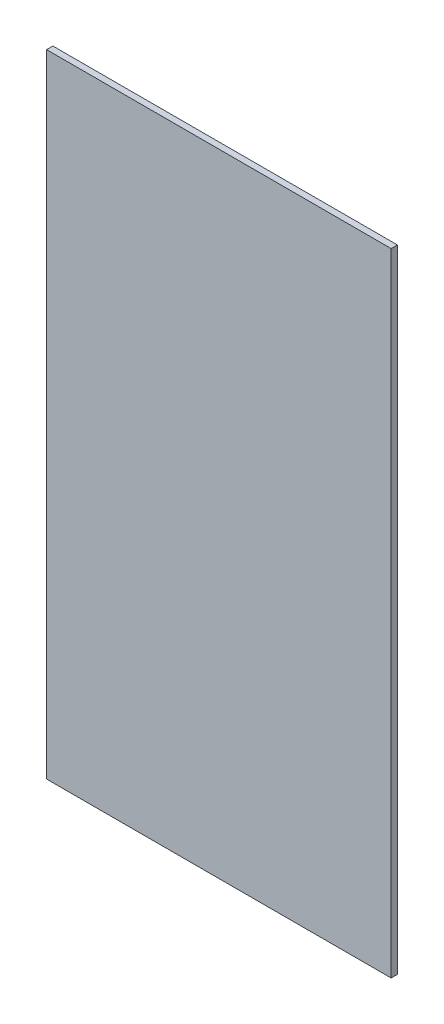
ISO-10303-21;
HEADER;
FILE_DESCRIPTION(('STEP AP214'),'2;1');
FILE_NAME('part.step','',(''),(''),'','','');
FILE_SCHEMA(('AUTOMOTIVE_DESIGN { 1 0 10303 214 1 1 1 1 }'));
ENDSEC;
DATA;
#1=APPLICATION_CONTEXT('core data for automotive mechanical design processes');
#2=APPLICATION_PROTOCOL_DEFINITION('international standard','automotive_design',2000,#1);
#3=PRODUCT_CONTEXT('',#1,'mechanical');
#4=PRODUCT('Part','Part','',(#3));
#5=PRODUCT_RELATED_PRODUCT_CATEGORY('part','',(#4));
#6=PRODUCT_DEFINITION_FORMATION('','',#4);
#7=PRODUCT_DEFINITION_CONTEXT('part definition',#1,'design');
#8=PRODUCT_DEFINITION('design','',#6,#7);
#9=PRODUCT_DEFINITION_SHAPE('','',#8);
#10=(LENGTH_UNIT() NAMED_UNIT(*) SI_UNIT(.MILLI.,.METRE.));
#11=(NAMED_UNIT(*) PLANE_ANGLE_UNIT() SI_UNIT($,.RADIAN.));
#12=(NAMED_UNIT(*) SI_UNIT($,.STERADIAN.) SOLID_ANGLE_UNIT());
#13=UNCERTAINTY_MEASURE_WITH_UNIT(LENGTH_MEASURE(1.E-05),#10,'distance_accuracy_value','');
#14=(GEOMETRIC_REPRESENTATION_CONTEXT(3) GLOBAL_UNCERTAINTY_ASSIGNED_CONTEXT((#13)) GLOBAL_UNIT_ASSIGNED_CONTEXT((#10,
#11,#12)) REPRESENTATION_CONTEXT('',''));
#15=CARTESIAN_POINT('',(0.,0.,0.));
#16=DIRECTION('',(0.,0.,1.));
#17=DIRECTION('',(1.,0.,0.));
#18=AXIS2_PLACEMENT_3D('',#15,#16,#17);
#19=CARTESIAN_POINT('',(0.,0.,11.1125));
#20=DIRECTION('',(1.,0.,0.));
#21=DIRECTION('',(0.,0.,-1.));
#22=AXIS2_PLACEMENT_3D('',#19,#20,#21);
#23=PLANE('',#22);
#24=DIRECTION('',(0.,-1.,0.));
#25=VECTOR('',#24,1.);
#26=CARTESIAN_POINT('',(0.,0.,0.));
#27=LINE('',#26,#25);
#28=CARTESIAN_POINT('',(0.,1117.6,0.));
#29=VERTEX_POINT('',#28);
#30=CARTESIAN_POINT('',(0.,0.,0.));
#31=VERTEX_POINT('',#30);
#32=EDGE_CURVE('E98',#29,#31,#27,.T.);
#33=ORIENTED_EDGE('',*,*,#32,.T.);
#34=DIRECTION('',(0.,0.,-1.));
#35=VECTOR('',#34,1.);
#36=CARTESIAN_POINT('',(0.,0.,11.1125));
#37=LINE('',#36,#35);
#38=CARTESIAN_POINT('',(0.,0.,11.1125));
#39=VERTEX_POINT('',#38);
#40=EDGE_CURVE('E11',#39,#31,#37,.T.);
#41=ORIENTED_EDGE('',*,*,#40,.F.);
#42=DIRECTION('',(0.,-1.,0.));
#43=VECTOR('',#42,1.);
#44=CARTESIAN_POINT('',(0.,0.,11.1125));
#45=LINE('',#44,#43);
#46=CARTESIAN_POINT('',(0.,1117.6,11.1125));
#47=VERTEX_POINT('',#46);
#48=EDGE_CURVE('E86',#47,#39,#45,.T.);
#49=ORIENTED_EDGE('',*,*,#48,.F.);
#50=DIRECTION('',(0.,0.,-1.));
#51=VECTOR('',#50,1.);
#52=CARTESIAN_POINT('',(0.,1117.6,11.1125));
#53=LINE('',#52,#51);
#54=EDGE_CURVE('E94',#47,#29,#53,.T.);
#55=ORIENTED_EDGE('',*,*,#54,.T.);
#56=EDGE_LOOP('',(#33,#41,#49,#55));
#57=FACE_BOUND('',#56,.T.);
#58=ADVANCED_FACE('F35',(#57),#23,.F.);
#59=CARTESIAN_POINT('',(0.,0.,11.1125));
#60=DIRECTION('',(0.,1.,0.));
#61=DIRECTION('',(0.,0.,1.));
#62=AXIS2_PLACEMENT_3D('',#59,#60,#61);
#63=PLANE('',#62);
#64=DIRECTION('',(1.,0.,0.));
#65=VECTOR('',#64,1.);
#66=CARTESIAN_POINT('',(0.,0.,0.));
#67=LINE('',#66,#65);
#68=CARTESIAN_POINT('',(609.6,0.,0.));
#69=VERTEX_POINT('',#68);
#70=EDGE_CURVE('E90',#31,#69,#67,.T.);
#71=ORIENTED_EDGE('',*,*,#70,.T.);
#72=DIRECTION('',(0.,0.,-1.));
#73=VECTOR('',#72,1.);
#74=CARTESIAN_POINT('',(609.6,0.,11.1125));
#75=LINE('',#74,#73);
#76=CARTESIAN_POINT('',(609.6,0.,11.1125));
#77=VERTEX_POINT('',#76);
#78=EDGE_CURVE('E43',#77,#69,#75,.T.);
#79=ORIENTED_EDGE('',*,*,#78,.F.);
#80=DIRECTION('',(1.,0.,0.));
#81=VECTOR('',#80,1.);
#82=CARTESIAN_POINT('',(0.,0.,11.1125));
#83=LINE('',#82,#81);
#84=EDGE_CURVE('E81',#39,#77,#83,.T.);
#85=ORIENTED_EDGE('',*,*,#84,.F.);
#86=ORIENTED_EDGE('',*,*,#40,.T.);
#87=EDGE_LOOP('',(#71,#79,#85,#86));
#88=FACE_BOUND('',#87,.T.);
#89=ADVANCED_FACE('F89',(#88),#63,.F.);
#90=CARTESIAN_POINT('',(609.6,0.,11.1125));
#91=DIRECTION('',(-1.,0.,0.));
#92=DIRECTION('',(0.,0.,1.));
#93=AXIS2_PLACEMENT_3D('',#90,#91,#92);
#94=PLANE('',#93);
#95=DIRECTION('',(0.,1.,0.));
#96=VECTOR('',#95,1.);
#97=CARTESIAN_POINT('',(609.6,0.,0.));
#98=LINE('',#97,#96);
#99=CARTESIAN_POINT('',(609.6,1117.6,0.));
#100=VERTEX_POINT('',#99);
#101=EDGE_CURVE('E68',#69,#100,#98,.T.);
#102=ORIENTED_EDGE('',*,*,#101,.T.);
#103=DIRECTION('',(0.,0.,-1.));
#104=VECTOR('',#103,1.);
#105=CARTESIAN_POINT('',(609.6,1117.6,11.1125));
#106=LINE('',#105,#104);
#107=CARTESIAN_POINT('',(609.6,1117.6,11.1125));
#108=VERTEX_POINT('',#107);
#109=EDGE_CURVE('E91',#108,#100,#106,.T.);
#110=ORIENTED_EDGE('',*,*,#109,.F.);
#111=DIRECTION('',(0.,1.,0.));
#112=VECTOR('',#111,1.);
#113=CARTESIAN_POINT('',(609.6,0.,11.1125));
#114=LINE('',#113,#112);
#115=EDGE_CURVE('E84',#77,#108,#114,.T.);
#116=ORIENTED_EDGE('',*,*,#115,.F.);
#117=ORIENTED_EDGE('',*,*,#78,.T.);
#118=EDGE_LOOP('',(#102,#110,#116,#117));
#119=FACE_BOUND('',#118,.T.);
#120=ADVANCED_FACE('F92',(#119),#94,.F.);
#121=CARTESIAN_POINT('',(0.,1117.6,11.1125));
#122=DIRECTION('',(0.,-1.,0.));
#123=DIRECTION('',(0.,0.,-1.));
#124=AXIS2_PLACEMENT_3D('',#121,#122,#123);
#125=PLANE('',#124);
#126=DIRECTION('',(-1.,0.,0.));
#127=VECTOR('',#126,1.);
#128=CARTESIAN_POINT('',(0.,1117.6,0.));
#129=LINE('',#128,#127);
#130=EDGE_CURVE('E74',#100,#29,#129,.T.);
#131=ORIENTED_EDGE('',*,*,#130,.T.);
#132=ORIENTED_EDGE('',*,*,#54,.F.);
#133=DIRECTION('',(-1.,0.,0.));
#134=VECTOR('',#133,1.);
#135=CARTESIAN_POINT('',(0.,1117.6,11.1125));
#136=LINE('',#135,#134);
#137=EDGE_CURVE('E51',#108,#47,#136,.T.);
#138=ORIENTED_EDGE('',*,*,#137,.F.);
#139=ORIENTED_EDGE('',*,*,#109,.T.);
#140=EDGE_LOOP('',(#131,#132,#138,#139));
#141=FACE_BOUND('',#140,.T.);
#142=ADVANCED_FACE('F105',(#141),#125,.F.);
#143=CARTESIAN_POINT('',(0.,0.,11.1125));
#144=DIRECTION('',(0.,0.,-1.));
#145=DIRECTION('',(-1.,0.,0.));
#146=AXIS2_PLACEMENT_3D('',#143,#144,#145);
#147=PLANE('',#146);
#148=ORIENTED_EDGE('',*,*,#48,.T.);
#149=ORIENTED_EDGE('',*,*,#84,.T.);
#150=ORIENTED_EDGE('',*,*,#115,.T.);
#151=ORIENTED_EDGE('',*,*,#137,.T.);
#152=EDGE_LOOP('',(#148,#149,#150,#151));
#153=FACE_BOUND('',#152,.T.);
#154=ADVANCED_FACE('F82',(#153),#147,.F.);
#155=CARTESIAN_POINT('',(0.,0.,0.));
#156=DIRECTION('',(0.,0.,-1.));
#157=DIRECTION('',(-1.,0.,0.));
#158=AXIS2_PLACEMENT_3D('',#155,#156,#157);
#159=PLANE('',#158);
#160=ORIENTED_EDGE('',*,*,#32,.F.);
#161=ORIENTED_EDGE('',*,*,#130,.F.);
#162=ORIENTED_EDGE('',*,*,#101,.F.);
#163=ORIENTED_EDGE('',*,*,#70,.F.);
#164=EDGE_LOOP('',(#160,#161,#162,#163));
#165=FACE_BOUND('',#164,.T.);
#166=ADVANCED_FACE('F108',(#165),#159,.T.);
#167=CLOSED_SHELL('',(#58,#89,#120,#142,#154,#166));
#168=MANIFOLD_SOLID_BREP('B2',#167);
#169=ADVANCED_BREP_SHAPE_REPRESENTATION('',(#18,#168),#14);
#170=SHAPE_DEFINITION_REPRESENTATION(#9,#169);
ENDSEC;
END-ISO-10303-21;
